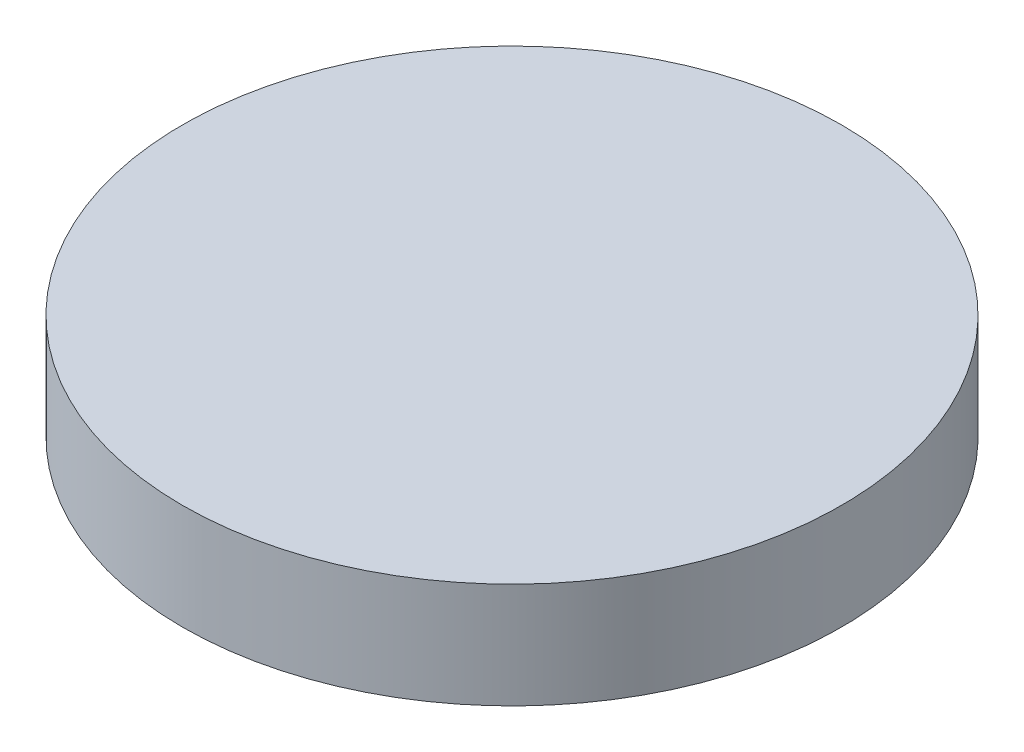
ISO-10303-21;
HEADER;
FILE_DESCRIPTION(('STEP AP214'),'2;1');
FILE_NAME('part.step','',(''),(''),'','','');
FILE_SCHEMA(('AUTOMOTIVE_DESIGN { 1 0 10303 214 1 1 1 1 }'));
ENDSEC;
DATA;
#1=APPLICATION_CONTEXT('core data for automotive mechanical design processes');
#2=APPLICATION_PROTOCOL_DEFINITION('international standard','automotive_design',2000,#1);
#3=PRODUCT_CONTEXT('',#1,'mechanical');
#4=PRODUCT('Part','Part','',(#3));
#5=PRODUCT_RELATED_PRODUCT_CATEGORY('part','',(#4));
#6=PRODUCT_DEFINITION_FORMATION('','',#4);
#7=PRODUCT_DEFINITION_CONTEXT('part definition',#1,'design');
#8=PRODUCT_DEFINITION('design','',#6,#7);
#9=PRODUCT_DEFINITION_SHAPE('','',#8);
#10=(LENGTH_UNIT() NAMED_UNIT(*) SI_UNIT(.MILLI.,.METRE.));
#11=(NAMED_UNIT(*) PLANE_ANGLE_UNIT() SI_UNIT($,.RADIAN.));
#12=(NAMED_UNIT(*) SI_UNIT($,.STERADIAN.) SOLID_ANGLE_UNIT());
#13=UNCERTAINTY_MEASURE_WITH_UNIT(LENGTH_MEASURE(1.E-05),#10,'distance_accuracy_value','');
#14=(GEOMETRIC_REPRESENTATION_CONTEXT(3) GLOBAL_UNCERTAINTY_ASSIGNED_CONTEXT((#13)) GLOBAL_UNIT_ASSIGNED_CONTEXT((#10,
#11,#12)) REPRESENTATION_CONTEXT('',''));
#15=CARTESIAN_POINT('',(0.,0.,0.));
#16=DIRECTION('',(0.,0.,1.));
#17=DIRECTION('',(1.,0.,0.));
#18=AXIS2_PLACEMENT_3D('',#15,#16,#17);
#19=CARTESIAN_POINT('',(0.,2.,0.));
#20=DIRECTION('',(0.,-1.,0.));
#21=DIRECTION('',(0.,0.,-1.));
#22=AXIS2_PLACEMENT_3D('',#19,#20,#21);
#23=CYLINDRICAL_SURFACE('',#22,6.25);
#24=CARTESIAN_POINT('',(0.,2.,0.));
#25=DIRECTION('',(0.,1.,0.));
#26=DIRECTION('',(0.,0.,1.));
#27=AXIS2_PLACEMENT_3D('',#24,#25,#26);
#28=CIRCLE('',#27,6.25);
#29=CARTESIAN_POINT('',(0.,2.,6.25));
#30=VERTEX_POINT('',#29);
#31=EDGE_CURVE('E10',#30,#30,#28,.T.);
#32=ORIENTED_EDGE('',*,*,#31,.F.);
#33=EDGE_LOOP('',(#32));
#34=FACE_BOUND('',#33,.T.);
#35=CARTESIAN_POINT('',(0.,0.,0.));
#36=DIRECTION('',(0.,1.,0.));
#37=DIRECTION('',(0.,0.,1.));
#38=AXIS2_PLACEMENT_3D('',#35,#36,#37);
#39=CIRCLE('',#38,6.25);
#40=CARTESIAN_POINT('',(0.,0.,6.25));
#41=VERTEX_POINT('',#40);
#42=EDGE_CURVE('E36',#41,#41,#39,.T.);
#43=ORIENTED_EDGE('',*,*,#42,.T.);
#44=EDGE_LOOP('',(#43));
#45=FACE_BOUND('',#44,.T.);
#46=ADVANCED_FACE('F33',(#34,#45),#23,.T.);
#47=CARTESIAN_POINT('',(0.,2.,0.));
#48=DIRECTION('',(0.,1.,0.));
#49=DIRECTION('',(0.,0.,1.));
#50=AXIS2_PLACEMENT_3D('',#47,#48,#49);
#51=PLANE('',#50);
#52=ORIENTED_EDGE('',*,*,#31,.T.);
#53=EDGE_LOOP('',(#52));
#54=FACE_BOUND('',#53,.T.);
#55=ADVANCED_FACE('F48',(#54),#51,.T.);
#56=CARTESIAN_POINT('',(0.,0.,0.));
#57=DIRECTION('',(0.,1.,0.));
#58=DIRECTION('',(0.,0.,1.));
#59=AXIS2_PLACEMENT_3D('',#56,#57,#58);
#60=PLANE('',#59);
#61=ORIENTED_EDGE('',*,*,#42,.F.);
#62=EDGE_LOOP('',(#61));
#63=FACE_BOUND('',#62,.T.);
#64=ADVANCED_FACE('F46',(#63),#60,.F.);
#65=CLOSED_SHELL('',(#46,#55,#64));
#66=MANIFOLD_SOLID_BREP('B2',#65);
#67=ADVANCED_BREP_SHAPE_REPRESENTATION('',(#18,#66),#14);
#68=SHAPE_DEFINITION_REPRESENTATION(#9,#67);
ENDSEC;
END-ISO-10303-21;
